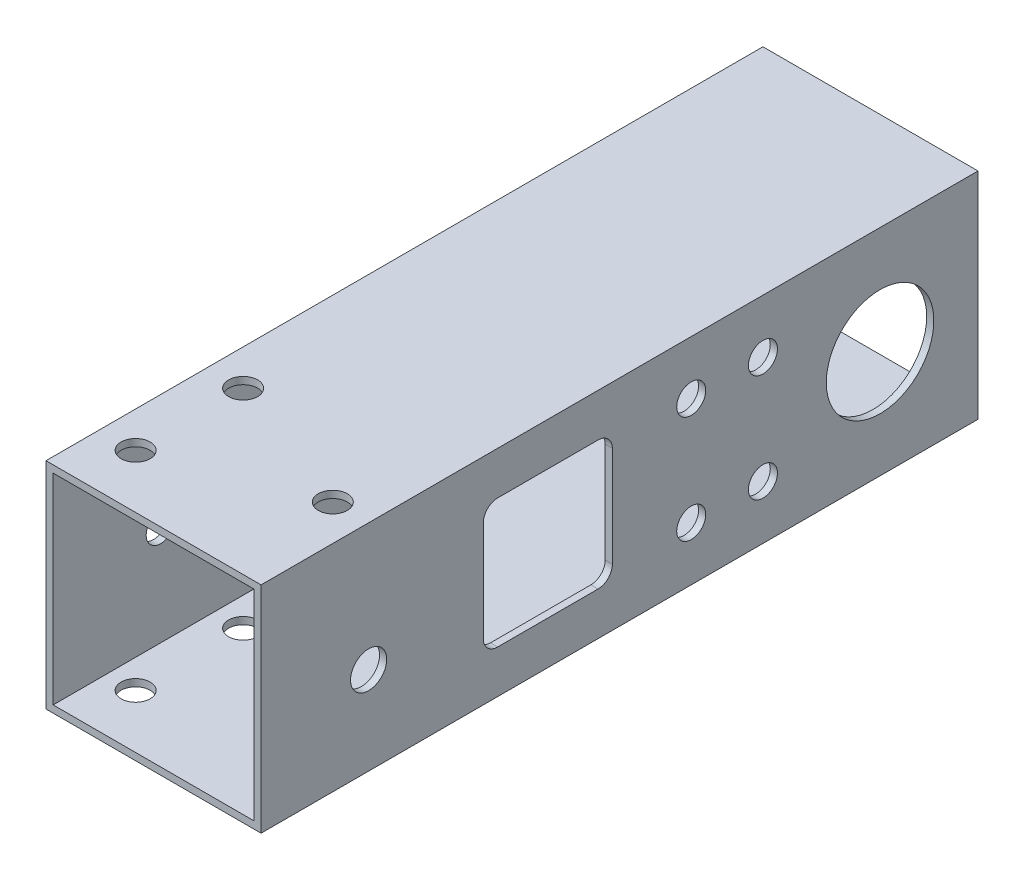
ISO-10303-21;
HEADER;
FILE_DESCRIPTION(('STEP AP214'),'2;1');
FILE_NAME('part.step','',(''),(''),'','','');
FILE_SCHEMA(('AUTOMOTIVE_DESIGN { 1 0 10303 214 1 1 1 1 }'));
ENDSEC;
DATA;
#1=APPLICATION_CONTEXT('core data for automotive mechanical design processes');
#2=APPLICATION_PROTOCOL_DEFINITION('international standard','automotive_design',2000,#1);
#3=PRODUCT_CONTEXT('',#1,'mechanical');
#4=PRODUCT('Part','Part','',(#3));
#5=PRODUCT_RELATED_PRODUCT_CATEGORY('part','',(#4));
#6=PRODUCT_DEFINITION_FORMATION('','',#4);
#7=PRODUCT_DEFINITION_CONTEXT('part definition',#1,'design');
#8=PRODUCT_DEFINITION('design','',#6,#7);
#9=PRODUCT_DEFINITION_SHAPE('','',#8);
#10=(LENGTH_UNIT() NAMED_UNIT(*) SI_UNIT(.MILLI.,.METRE.));
#11=(NAMED_UNIT(*) PLANE_ANGLE_UNIT() SI_UNIT($,.RADIAN.));
#12=(NAMED_UNIT(*) SI_UNIT($,.STERADIAN.) SOLID_ANGLE_UNIT());
#13=UNCERTAINTY_MEASURE_WITH_UNIT(LENGTH_MEASURE(1.E-05),#10,'distance_accuracy_value','');
#14=(GEOMETRIC_REPRESENTATION_CONTEXT(3) GLOBAL_UNCERTAINTY_ASSIGNED_CONTEXT((#13)) GLOBAL_UNIT_ASSIGNED_CONTEXT((#10,
#11,#12)) REPRESENTATION_CONTEXT('',''));
#15=CARTESIAN_POINT('',(0.,0.,0.));
#16=DIRECTION('',(0.,0.,1.));
#17=DIRECTION('',(1.,0.,0.));
#18=AXIS2_PLACEMENT_3D('',#15,#16,#17);
#19=CARTESIAN_POINT('',(15.,-15.,50.));
#20=DIRECTION('',(-1.,0.,0.));
#21=DIRECTION('',(0.,0.,1.));
#22=AXIS2_PLACEMENT_3D('',#19,#20,#21);
#23=PLANE('',#22);
#24=CARTESIAN_POINT('',(15.,-2.75,35.));
#25=DIRECTION('',(1.,0.,0.));
#26=DIRECTION('',(0.,0.,-1.));
#27=AXIS2_PLACEMENT_3D('',#24,#25,#26);
#28=CIRCLE('',#27,2.525);
#29=CARTESIAN_POINT('',(15.,-2.75,32.475));
#30=VERTEX_POINT('',#29);
#31=EDGE_CURVE('E766',#30,#30,#28,.T.);
#32=ORIENTED_EDGE('',*,*,#31,.F.);
#33=EDGE_LOOP('',(#32));
#34=FACE_BOUND('',#33,.T.);
#35=CARTESIAN_POINT('',(15.,7.50000000000101,-10.0000000000182));
#36=DIRECTION('',(-1.,0.,0.));
#37=DIRECTION('',(0.,0.,1.));
#38=AXIS2_PLACEMENT_3D('',#35,#36,#37);
#39=CIRCLE('',#38,2.025);
#40=CARTESIAN_POINT('',(15.,7.50000000000101,-7.9750000000182));
#41=VERTEX_POINT('',#40);
#42=EDGE_CURVE('E290',#41,#41,#39,.T.);
#43=ORIENTED_EDGE('',*,*,#42,.T.);
#44=EDGE_LOOP('',(#43));
#45=FACE_BOUND('',#44,.T.);
#46=CARTESIAN_POINT('',(15.,-7.49999999999899,-10.0000000000182));
#47=DIRECTION('',(-1.,0.,0.));
#48=DIRECTION('',(0.,0.,1.));
#49=AXIS2_PLACEMENT_3D('',#46,#47,#48);
#50=CIRCLE('',#49,2.025);
#51=CARTESIAN_POINT('',(15.,-7.49999999999899,-7.9750000000182));
#52=VERTEX_POINT('',#51);
#53=EDGE_CURVE('E782',#52,#52,#50,.T.);
#54=ORIENTED_EDGE('',*,*,#53,.T.);
#55=EDGE_LOOP('',(#54));
#56=FACE_BOUND('',#55,.T.);
#57=CARTESIAN_POINT('',(15.,0.,-36.3414768572115));
#58=DIRECTION('',(-1.,0.,0.));
#59=DIRECTION('',(0.,0.,1.));
#60=AXIS2_PLACEMENT_3D('',#57,#58,#59);
#61=CIRCLE('',#60,7.5);
#62=CARTESIAN_POINT('',(15.,0.,-28.8414768572115));
#63=VERTEX_POINT('',#62);
#64=EDGE_CURVE('E286',#63,#63,#61,.T.);
#65=ORIENTED_EDGE('',*,*,#64,.T.);
#66=EDGE_LOOP('',(#65));
#67=FACE_BOUND('',#66,.T.);
#68=CARTESIAN_POINT('',(15.,-7.49999999999899,-20.0000000000182));
#69=DIRECTION('',(-1.,0.,0.));
#70=DIRECTION('',(0.,0.,1.));
#71=AXIS2_PLACEMENT_3D('',#68,#69,#70);
#72=CIRCLE('',#71,2.025);
#73=CARTESIAN_POINT('',(15.,-7.49999999999899,-17.9750000000182));
#74=VERTEX_POINT('',#73);
#75=EDGE_CURVE('E276',#74,#74,#72,.T.);
#76=ORIENTED_EDGE('',*,*,#75,.T.);
#77=EDGE_LOOP('',(#76));
#78=FACE_BOUND('',#77,.T.);
#79=CARTESIAN_POINT('',(15.,7.50000000000101,-20.0000000000182));
#80=DIRECTION('',(-1.,0.,0.));
#81=DIRECTION('',(0.,0.,1.));
#82=AXIS2_PLACEMENT_3D('',#79,#80,#81);
#83=CIRCLE('',#82,2.025);
#84=CARTESIAN_POINT('',(15.,7.50000000000101,-17.9750000000182));
#85=VERTEX_POINT('',#84);
#86=EDGE_CURVE('E317',#85,#85,#83,.T.);
#87=ORIENTED_EDGE('',*,*,#86,.T.);
#88=EDGE_LOOP('',(#87));
#89=FACE_BOUND('',#88,.T.);
#90=DIRECTION('',(0.,0.,-1.));
#91=VECTOR('',#90,1.);
#92=CARTESIAN_POINT('',(15.,-8.99999999999998,0.99999999999998));
#93=LINE('',#92,#91);
#94=CARTESIAN_POINT('',(15.,-8.99999999999998,17.));
#95=VERTEX_POINT('',#94);
#96=CARTESIAN_POINT('',(15.,-8.99999999999998,2.99999999999998));
#97=VERTEX_POINT('',#96);
#98=EDGE_CURVE('E350',#95,#97,#93,.T.);
#99=ORIENTED_EDGE('',*,*,#98,.F.);
#100=CARTESIAN_POINT('',(15.,-6.99999999999998,17.));
#101=DIRECTION('',(-1.,0.,0.));
#102=DIRECTION('',(0.,0.,1.));
#103=AXIS2_PLACEMENT_3D('',#100,#101,#102);
#104=CIRCLE('',#103,2.);
#105=CARTESIAN_POINT('',(15.,-6.99999999999998,19.));
#106=VERTEX_POINT('',#105);
#107=EDGE_CURVE('E260',#95,#106,#104,.T.);
#108=ORIENTED_EDGE('',*,*,#107,.T.);
#109=DIRECTION('',(0.,-1.,0.));
#110=VECTOR('',#109,1.);
#111=CARTESIAN_POINT('',(15.,-8.99999999999998,19.));
#112=LINE('',#111,#110);
#113=CARTESIAN_POINT('',(15.,7.,19.));
#114=VERTEX_POINT('',#113);
#115=EDGE_CURVE('E354',#114,#106,#112,.T.);
#116=ORIENTED_EDGE('',*,*,#115,.F.);
#117=CARTESIAN_POINT('',(15.,7.,17.));
#118=DIRECTION('',(-1.,0.,0.));
#119=DIRECTION('',(0.,0.,1.));
#120=AXIS2_PLACEMENT_3D('',#117,#118,#119);
#121=CIRCLE('',#120,2.);
#122=CARTESIAN_POINT('',(15.,9.,17.));
#123=VERTEX_POINT('',#122);
#124=EDGE_CURVE('E257',#114,#123,#121,.T.);
#125=ORIENTED_EDGE('',*,*,#124,.T.);
#126=DIRECTION('',(0.,0.,1.));
#127=VECTOR('',#126,1.);
#128=CARTESIAN_POINT('',(15.,9.,0.99999999999998));
#129=LINE('',#128,#127);
#130=CARTESIAN_POINT('',(15.,9.,2.99999999999998));
#131=VERTEX_POINT('',#130);
#132=EDGE_CURVE('E357',#131,#123,#129,.T.);
#133=ORIENTED_EDGE('',*,*,#132,.F.);
#134=CARTESIAN_POINT('',(15.,7.,2.99999999999998));
#135=DIRECTION('',(-1.,0.,0.));
#136=DIRECTION('',(0.,0.,1.));
#137=AXIS2_PLACEMENT_3D('',#134,#135,#136);
#138=CIRCLE('',#137,2.);
#139=CARTESIAN_POINT('',(15.,7.,0.99999999999998));
#140=VERTEX_POINT('',#139);
#141=EDGE_CURVE('E11',#131,#140,#138,.T.);
#142=ORIENTED_EDGE('',*,*,#141,.T.);
#143=DIRECTION('',(0.,1.,0.));
#144=VECTOR('',#143,1.);
#145=CARTESIAN_POINT('',(15.,-8.99999999999998,0.99999999999998));
#146=LINE('',#145,#144);
#147=CARTESIAN_POINT('',(15.,-6.99999999999998,0.99999999999998));
#148=VERTEX_POINT('',#147);
#149=EDGE_CURVE('E347',#148,#140,#146,.T.);
#150=ORIENTED_EDGE('',*,*,#149,.F.);
#151=CARTESIAN_POINT('',(15.,-6.99999999999998,2.99999999999998));
#152=DIRECTION('',(-1.,0.,0.));
#153=DIRECTION('',(0.,0.,1.));
#154=AXIS2_PLACEMENT_3D('',#151,#152,#153);
#155=CIRCLE('',#154,2.);
#156=EDGE_CURVE('E254',#148,#97,#155,.T.);
#157=ORIENTED_EDGE('',*,*,#156,.T.);
#158=EDGE_LOOP('',(#99,#108,#116,#125,#133,#142,#150,#157));
#159=FACE_BOUND('',#158,.T.);
#160=DIRECTION('',(0.,1.,0.));
#161=VECTOR('',#160,1.);
#162=CARTESIAN_POINT('',(15.,-15.,-50.));
#163=LINE('',#162,#161);
#164=CARTESIAN_POINT('',(15.,-15.,-50.));
#165=VERTEX_POINT('',#164);
#166=CARTESIAN_POINT('',(15.,15.,-50.));
#167=VERTEX_POINT('',#166);
#168=EDGE_CURVE('E203',#165,#167,#163,.T.);
#169=ORIENTED_EDGE('',*,*,#168,.T.);
#170=DIRECTION('',(0.,0.,-1.));
#171=VECTOR('',#170,1.);
#172=CARTESIAN_POINT('',(15.,15.,50.));
#173=LINE('',#172,#171);
#174=CARTESIAN_POINT('',(15.,15.,50.));
#175=VERTEX_POINT('',#174);
#176=EDGE_CURVE('E230',#175,#167,#173,.T.);
#177=ORIENTED_EDGE('',*,*,#176,.F.);
#178=DIRECTION('',(0.,1.,0.));
#179=VECTOR('',#178,1.);
#180=CARTESIAN_POINT('',(15.,-15.,50.));
#181=LINE('',#180,#179);
#182=CARTESIAN_POINT('',(15.,-15.,50.));
#183=VERTEX_POINT('',#182);
#184=EDGE_CURVE('E204',#183,#175,#181,.T.);
#185=ORIENTED_EDGE('',*,*,#184,.F.);
#186=DIRECTION('',(0.,0.,-1.));
#187=VECTOR('',#186,1.);
#188=CARTESIAN_POINT('',(15.,-15.,50.));
#189=LINE('',#188,#187);
#190=EDGE_CURVE('E214',#183,#165,#189,.T.);
#191=ORIENTED_EDGE('',*,*,#190,.T.);
#192=EDGE_LOOP('',(#169,#177,#185,#191));
#193=FACE_BOUND('',#192,.T.);
#194=ADVANCED_FACE('F35',(#34,#45,#56,#67,#78,#89,#159,#193),#23,.F.);
#195=CARTESIAN_POINT('',(-15.,15.,50.));
#196=DIRECTION('',(0.,-1.,0.));
#197=DIRECTION('',(0.,0.,-1.));
#198=AXIS2_PLACEMENT_3D('',#195,#196,#197);
#199=PLANE('',#198);
#200=CARTESIAN_POINT('',(10.,15.,35.));
#201=DIRECTION('',(0.,-1.,0.));
#202=DIRECTION('',(0.,0.,-1.));
#203=AXIS2_PLACEMENT_3D('',#200,#201,#202);
#204=CIRCLE('',#203,2.025);
#205=CARTESIAN_POINT('',(10.,15.,32.975));
#206=VERTEX_POINT('',#205);
#207=EDGE_CURVE('E779',#206,#206,#204,.T.);
#208=ORIENTED_EDGE('',*,*,#207,.T.);
#209=EDGE_LOOP('',(#208));
#210=FACE_BOUND('',#209,.T.);
#211=CARTESIAN_POINT('',(-9.99999999999999,15.,27.5));
#212=DIRECTION('',(0.,1.,0.));
#213=DIRECTION('',(0.,0.,1.));
#214=AXIS2_PLACEMENT_3D('',#211,#212,#213);
#215=CIRCLE('',#214,2.025);
#216=CARTESIAN_POINT('',(-9.99999999999999,15.,29.525));
#217=VERTEX_POINT('',#216);
#218=EDGE_CURVE('E332',#217,#217,#215,.T.);
#219=ORIENTED_EDGE('',*,*,#218,.F.);
#220=EDGE_LOOP('',(#219));
#221=FACE_BOUND('',#220,.T.);
#222=CARTESIAN_POINT('',(-9.99999999999999,15.,42.5));
#223=DIRECTION('',(0.,1.,0.));
#224=DIRECTION('',(0.,0.,1.));
#225=AXIS2_PLACEMENT_3D('',#222,#223,#224);
#226=CIRCLE('',#225,2.025);
#227=CARTESIAN_POINT('',(-9.99999999999999,15.,44.525));
#228=VERTEX_POINT('',#227);
#229=EDGE_CURVE('E335',#228,#228,#226,.T.);
#230=ORIENTED_EDGE('',*,*,#229,.F.);
#231=EDGE_LOOP('',(#230));
#232=FACE_BOUND('',#231,.T.);
#233=DIRECTION('',(-1.,0.,0.));
#234=VECTOR('',#233,1.);
#235=CARTESIAN_POINT('',(-15.,15.,-50.));
#236=LINE('',#235,#234);
#237=CARTESIAN_POINT('',(-15.,15.,-50.));
#238=VERTEX_POINT('',#237);
#239=EDGE_CURVE('E217',#167,#238,#236,.T.);
#240=ORIENTED_EDGE('',*,*,#239,.T.);
#241=DIRECTION('',(0.,0.,-1.));
#242=VECTOR('',#241,1.);
#243=CARTESIAN_POINT('',(-15.,15.,50.));
#244=LINE('',#243,#242);
#245=CARTESIAN_POINT('',(-15.,15.,50.));
#246=VERTEX_POINT('',#245);
#247=EDGE_CURVE('E227',#246,#238,#244,.T.);
#248=ORIENTED_EDGE('',*,*,#247,.F.);
#249=DIRECTION('',(-1.,0.,0.));
#250=VECTOR('',#249,1.);
#251=CARTESIAN_POINT('',(-15.,15.,50.));
#252=LINE('',#251,#250);
#253=EDGE_CURVE('E207',#175,#246,#252,.T.);
#254=ORIENTED_EDGE('',*,*,#253,.F.);
#255=ORIENTED_EDGE('',*,*,#176,.T.);
#256=EDGE_LOOP('',(#240,#248,#254,#255));
#257=FACE_BOUND('',#256,.T.);
#258=ADVANCED_FACE('F402',(#210,#221,#232,#257),#199,.F.);
#259=CARTESIAN_POINT('',(-15.,-15.,50.));
#260=DIRECTION('',(1.,0.,0.));
#261=DIRECTION('',(0.,0.,-1.));
#262=AXIS2_PLACEMENT_3D('',#259,#260,#261);
#263=PLANE('',#262);
#264=CARTESIAN_POINT('',(-15.,7.50000000000101,-10.0000000000182));
#265=DIRECTION('',(1.,0.,0.));
#266=DIRECTION('',(0.,0.,-1.));
#267=AXIS2_PLACEMENT_3D('',#264,#265,#266);
#268=CIRCLE('',#267,2.025);
#269=CARTESIAN_POINT('',(-15.,7.50000000000101,-12.0250000000182));
#270=VERTEX_POINT('',#269);
#271=EDGE_CURVE('E298',#270,#270,#268,.T.);
#272=ORIENTED_EDGE('',*,*,#271,.T.);
#273=EDGE_LOOP('',(#272));
#274=FACE_BOUND('',#273,.T.);
#275=CARTESIAN_POINT('',(-15.,-7.49999999999899,-10.0000000000182));
#276=DIRECTION('',(1.,0.,0.));
#277=DIRECTION('',(0.,0.,-1.));
#278=AXIS2_PLACEMENT_3D('',#275,#276,#277);
#279=CIRCLE('',#278,2.025);
#280=CARTESIAN_POINT('',(-15.,-7.49999999999899,-12.0250000000182));
#281=VERTEX_POINT('',#280);
#282=EDGE_CURVE('E294',#281,#281,#279,.T.);
#283=ORIENTED_EDGE('',*,*,#282,.T.);
#284=EDGE_LOOP('',(#283));
#285=FACE_BOUND('',#284,.T.);
#286=CARTESIAN_POINT('',(-15.,0.,-36.3414768572115));
#287=DIRECTION('',(-1.,0.,0.));
#288=DIRECTION('',(0.,0.,1.));
#289=AXIS2_PLACEMENT_3D('',#286,#287,#288);
#290=CIRCLE('',#289,7.5);
#291=CARTESIAN_POINT('',(-15.,0.,-28.8414768572115));
#292=VERTEX_POINT('',#291);
#293=EDGE_CURVE('E310',#292,#292,#290,.T.);
#294=ORIENTED_EDGE('',*,*,#293,.F.);
#295=EDGE_LOOP('',(#294));
#296=FACE_BOUND('',#295,.T.);
#297=CARTESIAN_POINT('',(-15.,-7.49999999999899,-20.0000000000182));
#298=DIRECTION('',(1.,0.,0.));
#299=DIRECTION('',(0.,0.,-1.));
#300=AXIS2_PLACEMENT_3D('',#297,#298,#299);
#301=CIRCLE('',#300,2.025);
#302=CARTESIAN_POINT('',(-15.,-7.49999999999899,-22.0250000000182));
#303=VERTEX_POINT('',#302);
#304=EDGE_CURVE('E328',#303,#303,#301,.T.);
#305=ORIENTED_EDGE('',*,*,#304,.T.);
#306=EDGE_LOOP('',(#305));
#307=FACE_BOUND('',#306,.T.);
#308=CARTESIAN_POINT('',(-15.,7.50000000000101,-20.0000000000182));
#309=DIRECTION('',(1.,0.,0.));
#310=DIRECTION('',(0.,0.,-1.));
#311=AXIS2_PLACEMENT_3D('',#308,#309,#310);
#312=CIRCLE('',#311,2.025);
#313=CARTESIAN_POINT('',(-15.,7.50000000000101,-22.0250000000182));
#314=VERTEX_POINT('',#313);
#315=EDGE_CURVE('E281',#314,#314,#312,.T.);
#316=ORIENTED_EDGE('',*,*,#315,.T.);
#317=EDGE_LOOP('',(#316));
#318=FACE_BOUND('',#317,.T.);
#319=CARTESIAN_POINT('',(-15.,0.,9.99999999999997));
#320=DIRECTION('',(-1.,0.,0.));
#321=DIRECTION('',(0.,0.,1.));
#322=AXIS2_PLACEMENT_3D('',#319,#320,#321);
#323=CIRCLE('',#322,2.025);
#324=CARTESIAN_POINT('',(-15.,0.,12.025));
#325=VERTEX_POINT('',#324);
#326=EDGE_CURVE('E180',#325,#325,#323,.T.);
#327=ORIENTED_EDGE('',*,*,#326,.F.);
#328=EDGE_LOOP('',(#327));
#329=FACE_BOUND('',#328,.T.);
#330=CARTESIAN_POINT('',(-15.,0.,35.));
#331=DIRECTION('',(-1.,0.,0.));
#332=DIRECTION('',(0.,0.,1.));
#333=AXIS2_PLACEMENT_3D('',#330,#331,#332);
#334=CIRCLE('',#333,2.02499999999999);
#335=CARTESIAN_POINT('',(-15.,0.,37.025));
#336=VERTEX_POINT('',#335);
#337=EDGE_CURVE('E369',#336,#336,#334,.T.);
#338=ORIENTED_EDGE('',*,*,#337,.F.);
#339=EDGE_LOOP('',(#338));
#340=FACE_BOUND('',#339,.T.);
#341=DIRECTION('',(0.,-1.,0.));
#342=VECTOR('',#341,1.);
#343=CARTESIAN_POINT('',(-15.,-15.,-50.));
#344=LINE('',#343,#342);
#345=CARTESIAN_POINT('',(-15.,-15.,-50.));
#346=VERTEX_POINT('',#345);
#347=EDGE_CURVE('E219',#238,#346,#344,.T.);
#348=ORIENTED_EDGE('',*,*,#347,.T.);
#349=DIRECTION('',(0.,0.,-1.));
#350=VECTOR('',#349,1.);
#351=CARTESIAN_POINT('',(-15.,-15.,50.));
#352=LINE('',#351,#350);
#353=CARTESIAN_POINT('',(-15.,-15.,50.));
#354=VERTEX_POINT('',#353);
#355=EDGE_CURVE('E224',#354,#346,#352,.T.);
#356=ORIENTED_EDGE('',*,*,#355,.F.);
#357=DIRECTION('',(0.,-1.,0.));
#358=VECTOR('',#357,1.);
#359=CARTESIAN_POINT('',(-15.,-15.,50.));
#360=LINE('',#359,#358);
#361=EDGE_CURVE('E210',#246,#354,#360,.T.);
#362=ORIENTED_EDGE('',*,*,#361,.F.);
#363=ORIENTED_EDGE('',*,*,#247,.T.);
#364=EDGE_LOOP('',(#348,#356,#362,#363));
#365=FACE_BOUND('',#364,.T.);
#366=ADVANCED_FACE('F409',(#274,#285,#296,#307,#318,#329,#340,#365),#263,.F.);
#367=CARTESIAN_POINT('',(-15.,-15.,50.));
#368=DIRECTION('',(0.,1.,0.));
#369=DIRECTION('',(0.,0.,1.));
#370=AXIS2_PLACEMENT_3D('',#367,#368,#369);
#371=PLANE('',#370);
#372=CARTESIAN_POINT('',(10.,-15.,35.));
#373=DIRECTION('',(0.,1.,0.));
#374=DIRECTION('',(0.,0.,1.));
#375=AXIS2_PLACEMENT_3D('',#372,#373,#374);
#376=CIRCLE('',#375,2.025);
#377=CARTESIAN_POINT('',(10.,-15.,37.025));
#378=VERTEX_POINT('',#377);
#379=EDGE_CURVE('E770',#378,#378,#376,.T.);
#380=ORIENTED_EDGE('',*,*,#379,.T.);
#381=EDGE_LOOP('',(#380));
#382=FACE_BOUND('',#381,.T.);
#383=CARTESIAN_POINT('',(-9.99999999999999,-15.,27.5));
#384=DIRECTION('',(0.,1.,0.));
#385=DIRECTION('',(0.,0.,1.));
#386=AXIS2_PLACEMENT_3D('',#383,#384,#385);
#387=CIRCLE('',#386,2.025);
#388=CARTESIAN_POINT('',(-9.99999999999999,-15.,29.525));
#389=VERTEX_POINT('',#388);
#390=EDGE_CURVE('E267',#389,#389,#387,.T.);
#391=ORIENTED_EDGE('',*,*,#390,.T.);
#392=EDGE_LOOP('',(#391));
#393=FACE_BOUND('',#392,.T.);
#394=CARTESIAN_POINT('',(-9.99999999999999,-15.,42.5));
#395=DIRECTION('',(0.,1.,0.));
#396=DIRECTION('',(0.,0.,1.));
#397=AXIS2_PLACEMENT_3D('',#394,#395,#396);
#398=CIRCLE('',#397,2.025);
#399=CARTESIAN_POINT('',(-9.99999999999999,-15.,44.525));
#400=VERTEX_POINT('',#399);
#401=EDGE_CURVE('E331',#400,#400,#398,.T.);
#402=ORIENTED_EDGE('',*,*,#401,.T.);
#403=EDGE_LOOP('',(#402));
#404=FACE_BOUND('',#403,.T.);
#405=DIRECTION('',(1.,0.,0.));
#406=VECTOR('',#405,1.);
#407=CARTESIAN_POINT('',(-15.,-15.,-50.));
#408=LINE('',#407,#406);
#409=EDGE_CURVE('E208',#346,#165,#408,.T.);
#410=ORIENTED_EDGE('',*,*,#409,.T.);
#411=ORIENTED_EDGE('',*,*,#190,.F.);
#412=DIRECTION('',(1.,0.,0.));
#413=VECTOR('',#412,1.);
#414=CARTESIAN_POINT('',(-15.,-15.,50.));
#415=LINE('',#414,#413);
#416=EDGE_CURVE('E212',#354,#183,#415,.T.);
#417=ORIENTED_EDGE('',*,*,#416,.F.);
#418=ORIENTED_EDGE('',*,*,#355,.T.);
#419=EDGE_LOOP('',(#410,#411,#417,#418));
#420=FACE_BOUND('',#419,.T.);
#421=ADVANCED_FACE('F629',(#382,#393,#404,#420),#371,.F.);
#422=CARTESIAN_POINT('',(0.,0.,50.));
#423=DIRECTION('',(0.,0.,-1.));
#424=DIRECTION('',(-1.,0.,0.));
#425=AXIS2_PLACEMENT_3D('',#422,#423,#424);
#426=PLANE('',#425);
#427=DIRECTION('',(0.,-1.,0.));
#428=VECTOR('',#427,1.);
#429=CARTESIAN_POINT('',(14.,0.,50.));
#430=LINE('',#429,#428);
#431=CARTESIAN_POINT('',(14.,14.,50.));
#432=VERTEX_POINT('',#431);
#433=CARTESIAN_POINT('',(14.,-14.,50.));
#434=VERTEX_POINT('',#433);
#435=EDGE_CURVE('E190',#432,#434,#430,.T.);
#436=ORIENTED_EDGE('',*,*,#435,.T.);
#437=DIRECTION('',(-1.,0.,0.));
#438=VECTOR('',#437,1.);
#439=CARTESIAN_POINT('',(0.,-14.,50.));
#440=LINE('',#439,#438);
#441=CARTESIAN_POINT('',(-14.,-14.,50.));
#442=VERTEX_POINT('',#441);
#443=EDGE_CURVE('E159',#434,#442,#440,.T.);
#444=ORIENTED_EDGE('',*,*,#443,.T.);
#445=DIRECTION('',(0.,1.,0.));
#446=VECTOR('',#445,1.);
#447=CARTESIAN_POINT('',(-14.,0.,50.));
#448=LINE('',#447,#446);
#449=CARTESIAN_POINT('',(-14.,14.,50.));
#450=VERTEX_POINT('',#449);
#451=EDGE_CURVE('E199',#442,#450,#448,.T.);
#452=ORIENTED_EDGE('',*,*,#451,.T.);
#453=DIRECTION('',(1.,0.,0.));
#454=VECTOR('',#453,1.);
#455=CARTESIAN_POINT('',(0.,14.,50.));
#456=LINE('',#455,#454);
#457=EDGE_CURVE('E196',#450,#432,#456,.T.);
#458=ORIENTED_EDGE('',*,*,#457,.T.);
#459=EDGE_LOOP('',(#436,#444,#452,#458));
#460=FACE_BOUND('',#459,.T.);
#461=ORIENTED_EDGE('',*,*,#184,.T.);
#462=ORIENTED_EDGE('',*,*,#253,.T.);
#463=ORIENTED_EDGE('',*,*,#361,.T.);
#464=ORIENTED_EDGE('',*,*,#416,.T.);
#465=EDGE_LOOP('',(#461,#462,#463,#464));
#466=FACE_BOUND('',#465,.T.);
#467=ADVANCED_FACE('F386',(#460,#466),#426,.F.);
#468=CARTESIAN_POINT('',(0.,0.,-50.));
#469=DIRECTION('',(0.,0.,-1.));
#470=DIRECTION('',(-1.,0.,0.));
#471=AXIS2_PLACEMENT_3D('',#468,#469,#470);
#472=PLANE('',#471);
#473=DIRECTION('',(1.,0.,0.));
#474=VECTOR('',#473,1.);
#475=CARTESIAN_POINT('',(-14.,-14.,-50.));
#476=LINE('',#475,#474);
#477=CARTESIAN_POINT('',(-14.,-14.,-50.));
#478=VERTEX_POINT('',#477);
#479=CARTESIAN_POINT('',(14.,-14.,-50.));
#480=VERTEX_POINT('',#479);
#481=EDGE_CURVE('E156',#478,#480,#476,.T.);
#482=ORIENTED_EDGE('',*,*,#481,.T.);
#483=DIRECTION('',(0.,1.,0.));
#484=VECTOR('',#483,1.);
#485=CARTESIAN_POINT('',(14.,-14.,-50.));
#486=LINE('',#485,#484);
#487=CARTESIAN_POINT('',(14.,14.,-50.));
#488=VERTEX_POINT('',#487);
#489=EDGE_CURVE('E167',#480,#488,#486,.T.);
#490=ORIENTED_EDGE('',*,*,#489,.T.);
#491=DIRECTION('',(-1.,0.,0.));
#492=VECTOR('',#491,1.);
#493=CARTESIAN_POINT('',(14.,14.,-50.));
#494=LINE('',#493,#492);
#495=CARTESIAN_POINT('',(-14.,14.,-50.));
#496=VERTEX_POINT('',#495);
#497=EDGE_CURVE('E172',#488,#496,#494,.T.);
#498=ORIENTED_EDGE('',*,*,#497,.T.);
#499=DIRECTION('',(0.,-1.,0.));
#500=VECTOR('',#499,1.);
#501=CARTESIAN_POINT('',(-14.,14.,-50.));
#502=LINE('',#501,#500);
#503=EDGE_CURVE('E163',#496,#478,#502,.T.);
#504=ORIENTED_EDGE('',*,*,#503,.T.);
#505=EDGE_LOOP('',(#482,#490,#498,#504));
#506=FACE_BOUND('',#505,.T.);
#507=ORIENTED_EDGE('',*,*,#168,.F.);
#508=ORIENTED_EDGE('',*,*,#409,.F.);
#509=ORIENTED_EDGE('',*,*,#347,.F.);
#510=ORIENTED_EDGE('',*,*,#239,.F.);
#511=EDGE_LOOP('',(#507,#508,#509,#510));
#512=FACE_BOUND('',#511,.T.);
#513=ADVANCED_FACE('F174',(#506,#512),#472,.T.);
#514=CARTESIAN_POINT('',(-14.,-14.,-50.));
#515=DIRECTION('',(0.,-1.,0.));
#516=DIRECTION('',(0.,0.,-1.));
#517=AXIS2_PLACEMENT_3D('',#514,#515,#516);
#518=PLANE('',#517);
#519=CARTESIAN_POINT('',(10.,-14.,35.));
#520=DIRECTION('',(0.,-1.,0.));
#521=DIRECTION('',(0.,0.,-1.));
#522=AXIS2_PLACEMENT_3D('',#519,#520,#521);
#523=CIRCLE('',#522,2.025);
#524=CARTESIAN_POINT('',(10.,-14.,32.975));
#525=VERTEX_POINT('',#524);
#526=EDGE_CURVE('E776',#525,#525,#523,.T.);
#527=ORIENTED_EDGE('',*,*,#526,.T.);
#528=EDGE_LOOP('',(#527));
#529=FACE_BOUND('',#528,.T.);
#530=CARTESIAN_POINT('',(-9.99999999999999,-14.,27.5));
#531=DIRECTION('',(0.,-1.,0.));
#532=DIRECTION('',(0.,0.,-1.));
#533=AXIS2_PLACEMENT_3D('',#530,#531,#532);
#534=CIRCLE('',#533,2.025);
#535=CARTESIAN_POINT('',(-9.99999999999999,-14.,25.475));
#536=VERTEX_POINT('',#535);
#537=EDGE_CURVE('E271',#536,#536,#534,.T.);
#538=ORIENTED_EDGE('',*,*,#537,.T.);
#539=EDGE_LOOP('',(#538));
#540=FACE_BOUND('',#539,.T.);
#541=CARTESIAN_POINT('',(-9.99999999999999,-14.,42.5));
#542=DIRECTION('',(0.,-1.,0.));
#543=DIRECTION('',(0.,0.,-1.));
#544=AXIS2_PLACEMENT_3D('',#541,#542,#543);
#545=CIRCLE('',#544,2.025);
#546=CARTESIAN_POINT('',(-9.99999999999999,-14.,40.475));
#547=VERTEX_POINT('',#546);
#548=EDGE_CURVE('E266',#547,#547,#545,.T.);
#549=ORIENTED_EDGE('',*,*,#548,.T.);
#550=EDGE_LOOP('',(#549));
#551=FACE_BOUND('',#550,.T.);
#552=DIRECTION('',(0.,0.,1.));
#553=VECTOR('',#552,1.);
#554=CARTESIAN_POINT('',(14.,-14.,-50.));
#555=LINE('',#554,#553);
#556=EDGE_CURVE('E151',#480,#434,#555,.T.);
#557=ORIENTED_EDGE('',*,*,#556,.F.);
#558=ORIENTED_EDGE('',*,*,#481,.F.);
#559=DIRECTION('',(0.,0.,1.));
#560=VECTOR('',#559,1.);
#561=CARTESIAN_POINT('',(-14.,-14.,-50.));
#562=LINE('',#561,#560);
#563=EDGE_CURVE('E188',#478,#442,#562,.T.);
#564=ORIENTED_EDGE('',*,*,#563,.T.);
#565=ORIENTED_EDGE('',*,*,#443,.F.);
#566=EDGE_LOOP('',(#557,#558,#564,#565));
#567=FACE_BOUND('',#566,.T.);
#568=ADVANCED_FACE('F153',(#529,#540,#551,#567),#518,.F.);
#569=CARTESIAN_POINT('',(-14.,14.,-50.));
#570=DIRECTION('',(-1.,0.,0.));
#571=DIRECTION('',(0.,0.,1.));
#572=AXIS2_PLACEMENT_3D('',#569,#570,#571);
#573=PLANE('',#572);
#574=CARTESIAN_POINT('',(-14.,7.50000000000101,-10.0000000000182));
#575=DIRECTION('',(-1.,0.,0.));
#576=DIRECTION('',(0.,0.,1.));
#577=AXIS2_PLACEMENT_3D('',#574,#575,#576);
#578=CIRCLE('',#577,2.025);
#579=CARTESIAN_POINT('',(-14.,7.50000000000101,-7.9750000000182));
#580=VERTEX_POINT('',#579);
#581=EDGE_CURVE('E293',#580,#580,#578,.T.);
#582=ORIENTED_EDGE('',*,*,#581,.T.);
#583=EDGE_LOOP('',(#582));
#584=FACE_BOUND('',#583,.T.);
#585=CARTESIAN_POINT('',(-14.,-7.49999999999899,-10.0000000000182));
#586=DIRECTION('',(-1.,0.,0.));
#587=DIRECTION('',(0.,0.,1.));
#588=AXIS2_PLACEMENT_3D('',#585,#586,#587);
#589=CIRCLE('',#588,2.025);
#590=CARTESIAN_POINT('',(-14.,-7.49999999999899,-7.9750000000182));
#591=VERTEX_POINT('',#590);
#592=EDGE_CURVE('E289',#591,#591,#589,.T.);
#593=ORIENTED_EDGE('',*,*,#592,.T.);
#594=EDGE_LOOP('',(#593));
#595=FACE_BOUND('',#594,.T.);
#596=CARTESIAN_POINT('',(-14.,0.,-36.3414768572115));
#597=DIRECTION('',(-1.,0.,0.));
#598=DIRECTION('',(0.,0.,1.));
#599=AXIS2_PLACEMENT_3D('',#596,#597,#598);
#600=CIRCLE('',#599,7.5);
#601=CARTESIAN_POINT('',(-14.,0.,-28.8414768572115));
#602=VERTEX_POINT('',#601);
#603=EDGE_CURVE('E285',#602,#602,#600,.T.);
#604=ORIENTED_EDGE('',*,*,#603,.T.);
#605=EDGE_LOOP('',(#604));
#606=FACE_BOUND('',#605,.T.);
#607=CARTESIAN_POINT('',(-14.,-7.49999999999899,-20.0000000000182));
#608=DIRECTION('',(-1.,0.,0.));
#609=DIRECTION('',(0.,0.,1.));
#610=AXIS2_PLACEMENT_3D('',#607,#608,#609);
#611=CIRCLE('',#610,2.025);
#612=CARTESIAN_POINT('',(-14.,-7.49999999999899,-17.9750000000182));
#613=VERTEX_POINT('',#612);
#614=EDGE_CURVE('E280',#613,#613,#611,.T.);
#615=ORIENTED_EDGE('',*,*,#614,.T.);
#616=EDGE_LOOP('',(#615));
#617=FACE_BOUND('',#616,.T.);
#618=CARTESIAN_POINT('',(-14.,7.50000000000101,-20.0000000000182));
#619=DIRECTION('',(-1.,0.,0.));
#620=DIRECTION('',(0.,0.,1.));
#621=AXIS2_PLACEMENT_3D('',#618,#619,#620);
#622=CIRCLE('',#621,2.025);
#623=CARTESIAN_POINT('',(-14.,7.50000000000101,-17.9750000000182));
#624=VERTEX_POINT('',#623);
#625=EDGE_CURVE('E275',#624,#624,#622,.T.);
#626=ORIENTED_EDGE('',*,*,#625,.T.);
#627=EDGE_LOOP('',(#626));
#628=FACE_BOUND('',#627,.T.);
#629=CARTESIAN_POINT('',(-14.,0.,9.99999999999997));
#630=DIRECTION('',(-1.,0.,0.));
#631=DIRECTION('',(0.,0.,1.));
#632=AXIS2_PLACEMENT_3D('',#629,#630,#631);
#633=CIRCLE('',#632,2.025);
#634=CARTESIAN_POINT('',(-14.,0.,12.025));
#635=VERTEX_POINT('',#634);
#636=EDGE_CURVE('E177',#635,#635,#633,.F.);
#637=ORIENTED_EDGE('',*,*,#636,.F.);
#638=EDGE_LOOP('',(#637));
#639=FACE_BOUND('',#638,.T.);
#640=CARTESIAN_POINT('',(-14.,0.,35.));
#641=DIRECTION('',(-1.,0.,0.));
#642=DIRECTION('',(0.,0.,1.));
#643=AXIS2_PLACEMENT_3D('',#640,#641,#642);
#644=CIRCLE('',#643,2.02499999999999);
#645=CARTESIAN_POINT('',(-14.,0.,37.025));
#646=VERTEX_POINT('',#645);
#647=EDGE_CURVE('E183',#646,#646,#644,.F.);
#648=ORIENTED_EDGE('',*,*,#647,.F.);
#649=EDGE_LOOP('',(#648));
#650=FACE_BOUND('',#649,.T.);
#651=ORIENTED_EDGE('',*,*,#563,.F.);
#652=ORIENTED_EDGE('',*,*,#503,.F.);
#653=DIRECTION('',(0.,0.,1.));
#654=VECTOR('',#653,1.);
#655=CARTESIAN_POINT('',(-14.,14.,-50.));
#656=LINE('',#655,#654);
#657=EDGE_CURVE('E191',#496,#450,#656,.T.);
#658=ORIENTED_EDGE('',*,*,#657,.T.);
#659=ORIENTED_EDGE('',*,*,#451,.F.);
#660=EDGE_LOOP('',(#651,#652,#658,#659));
#661=FACE_BOUND('',#660,.T.);
#662=ADVANCED_FACE('F379',(#584,#595,#606,#617,#628,#639,#650,#661),#573,.F.);
#663=CARTESIAN_POINT('',(14.,14.,-50.));
#664=DIRECTION('',(0.,1.,0.));
#665=DIRECTION('',(0.,0.,1.));
#666=AXIS2_PLACEMENT_3D('',#663,#664,#665);
#667=PLANE('',#666);
#668=CARTESIAN_POINT('',(10.,14.,35.));
#669=DIRECTION('',(0.,1.,0.));
#670=DIRECTION('',(0.,0.,1.));
#671=AXIS2_PLACEMENT_3D('',#668,#669,#670);
#672=CIRCLE('',#671,2.025);
#673=CARTESIAN_POINT('',(10.,14.,37.025));
#674=VERTEX_POINT('',#673);
#675=EDGE_CURVE('E39',#674,#674,#672,.T.);
#676=ORIENTED_EDGE('',*,*,#675,.T.);
#677=EDGE_LOOP('',(#676));
#678=FACE_BOUND('',#677,.T.);
#679=CARTESIAN_POINT('',(-9.99999999999999,14.,27.5));
#680=DIRECTION('',(0.,1.,0.));
#681=DIRECTION('',(0.,0.,1.));
#682=AXIS2_PLACEMENT_3D('',#679,#680,#681);
#683=CIRCLE('',#682,2.025);
#684=CARTESIAN_POINT('',(-9.99999999999999,14.,29.525));
#685=VERTEX_POINT('',#684);
#686=EDGE_CURVE('E268',#685,#685,#683,.T.);
#687=ORIENTED_EDGE('',*,*,#686,.T.);
#688=EDGE_LOOP('',(#687));
#689=FACE_BOUND('',#688,.T.);
#690=CARTESIAN_POINT('',(-9.99999999999999,14.,42.5));
#691=DIRECTION('',(0.,1.,0.));
#692=DIRECTION('',(0.,0.,1.));
#693=AXIS2_PLACEMENT_3D('',#690,#691,#692);
#694=CIRCLE('',#693,2.025);
#695=CARTESIAN_POINT('',(-9.99999999999999,14.,44.525));
#696=VERTEX_POINT('',#695);
#697=EDGE_CURVE('E263',#696,#696,#694,.T.);
#698=ORIENTED_EDGE('',*,*,#697,.T.);
#699=EDGE_LOOP('',(#698));
#700=FACE_BOUND('',#699,.T.);
#701=ORIENTED_EDGE('',*,*,#657,.F.);
#702=ORIENTED_EDGE('',*,*,#497,.F.);
#703=DIRECTION('',(0.,0.,1.));
#704=VECTOR('',#703,1.);
#705=CARTESIAN_POINT('',(14.,14.,-50.));
#706=LINE('',#705,#704);
#707=EDGE_CURVE('E162',#488,#432,#706,.T.);
#708=ORIENTED_EDGE('',*,*,#707,.T.);
#709=ORIENTED_EDGE('',*,*,#457,.F.);
#710=EDGE_LOOP('',(#701,#702,#708,#709));
#711=FACE_BOUND('',#710,.T.);
#712=ADVANCED_FACE('F382',(#678,#689,#700,#711),#667,.F.);
#713=CARTESIAN_POINT('',(14.,-14.,-50.));
#714=DIRECTION('',(1.,0.,0.));
#715=DIRECTION('',(0.,0.,-1.));
#716=AXIS2_PLACEMENT_3D('',#713,#714,#715);
#717=PLANE('',#716);
#718=CARTESIAN_POINT('',(14.,-2.75,35.));
#719=DIRECTION('',(1.,0.,0.));
#720=DIRECTION('',(0.,0.,-1.));
#721=AXIS2_PLACEMENT_3D('',#718,#719,#720);
#722=CIRCLE('',#721,2.525);
#723=CARTESIAN_POINT('',(14.,-2.75,32.475));
#724=VERTEX_POINT('',#723);
#725=EDGE_CURVE('E769',#724,#724,#722,.F.);
#726=ORIENTED_EDGE('',*,*,#725,.F.);
#727=EDGE_LOOP('',(#726));
#728=FACE_BOUND('',#727,.T.);
#729=CARTESIAN_POINT('',(14.,7.50000000000101,-10.0000000000182));
#730=DIRECTION('',(1.,0.,0.));
#731=DIRECTION('',(0.,0.,-1.));
#732=AXIS2_PLACEMENT_3D('',#729,#730,#731);
#733=CIRCLE('',#732,2.025);
#734=CARTESIAN_POINT('',(14.,7.50000000000101,-12.0250000000182));
#735=VERTEX_POINT('',#734);
#736=EDGE_CURVE('E291',#735,#735,#733,.T.);
#737=ORIENTED_EDGE('',*,*,#736,.T.);
#738=EDGE_LOOP('',(#737));
#739=FACE_BOUND('',#738,.T.);
#740=CARTESIAN_POINT('',(14.,-7.49999999999899,-10.0000000000182));
#741=DIRECTION('',(1.,0.,0.));
#742=DIRECTION('',(0.,0.,-1.));
#743=AXIS2_PLACEMENT_3D('',#740,#741,#742);
#744=CIRCLE('',#743,2.025);
#745=CARTESIAN_POINT('',(14.,-7.49999999999899,-12.0250000000182));
#746=VERTEX_POINT('',#745);
#747=EDGE_CURVE('E287',#746,#746,#744,.T.);
#748=ORIENTED_EDGE('',*,*,#747,.T.);
#749=EDGE_LOOP('',(#748));
#750=FACE_BOUND('',#749,.T.);
#751=CARTESIAN_POINT('',(14.,0.,-36.3414768572115));
#752=DIRECTION('',(1.,0.,0.));
#753=DIRECTION('',(0.,0.,-1.));
#754=AXIS2_PLACEMENT_3D('',#751,#752,#753);
#755=CIRCLE('',#754,7.5);
#756=CARTESIAN_POINT('',(14.,0.,-43.8414768572115));
#757=VERTEX_POINT('',#756);
#758=EDGE_CURVE('E282',#757,#757,#755,.T.);
#759=ORIENTED_EDGE('',*,*,#758,.T.);
#760=EDGE_LOOP('',(#759));
#761=FACE_BOUND('',#760,.T.);
#762=CARTESIAN_POINT('',(14.,-7.49999999999899,-20.0000000000182));
#763=DIRECTION('',(1.,0.,0.));
#764=DIRECTION('',(0.,0.,-1.));
#765=AXIS2_PLACEMENT_3D('',#762,#763,#764);
#766=CIRCLE('',#765,2.025);
#767=CARTESIAN_POINT('',(14.,-7.49999999999899,-22.0250000000182));
#768=VERTEX_POINT('',#767);
#769=EDGE_CURVE('E277',#768,#768,#766,.T.);
#770=ORIENTED_EDGE('',*,*,#769,.T.);
#771=EDGE_LOOP('',(#770));
#772=FACE_BOUND('',#771,.T.);
#773=CARTESIAN_POINT('',(14.,7.50000000000101,-20.0000000000182));
#774=DIRECTION('',(1.,0.,0.));
#775=DIRECTION('',(0.,0.,-1.));
#776=AXIS2_PLACEMENT_3D('',#773,#774,#775);
#777=CIRCLE('',#776,2.025);
#778=CARTESIAN_POINT('',(14.,7.50000000000101,-22.0250000000182));
#779=VERTEX_POINT('',#778);
#780=EDGE_CURVE('E272',#779,#779,#777,.T.);
#781=ORIENTED_EDGE('',*,*,#780,.T.);
#782=EDGE_LOOP('',(#781));
#783=FACE_BOUND('',#782,.T.);
#784=DIRECTION('',(0.,0.,-1.));
#785=VECTOR('',#784,1.);
#786=CARTESIAN_POINT('',(14.,9.,0.99999999999998));
#787=LINE('',#786,#785);
#788=CARTESIAN_POINT('',(14.,9.,17.));
#789=VERTEX_POINT('',#788);
#790=CARTESIAN_POINT('',(14.,9.,2.99999999999998));
#791=VERTEX_POINT('',#790);
#792=EDGE_CURVE('E359',#789,#791,#787,.T.);
#793=ORIENTED_EDGE('',*,*,#792,.F.);
#794=CARTESIAN_POINT('',(14.,7.,17.));
#795=DIRECTION('',(1.,0.,0.));
#796=DIRECTION('',(0.,0.,-1.));
#797=AXIS2_PLACEMENT_3D('',#794,#795,#796);
#798=CIRCLE('',#797,2.);
#799=CARTESIAN_POINT('',(14.,7.,19.));
#800=VERTEX_POINT('',#799);
#801=EDGE_CURVE('E52',#789,#800,#798,.T.);
#802=ORIENTED_EDGE('',*,*,#801,.T.);
#803=DIRECTION('',(0.,1.,0.));
#804=VECTOR('',#803,1.);
#805=CARTESIAN_POINT('',(14.,-8.99999999999998,19.));
#806=LINE('',#805,#804);
#807=CARTESIAN_POINT('',(14.,-6.99999999999998,19.));
#808=VERTEX_POINT('',#807);
#809=EDGE_CURVE('E346',#808,#800,#806,.T.);
#810=ORIENTED_EDGE('',*,*,#809,.F.);
#811=CARTESIAN_POINT('',(14.,-6.99999999999998,17.));
#812=DIRECTION('',(1.,0.,0.));
#813=DIRECTION('',(0.,0.,-1.));
#814=AXIS2_PLACEMENT_3D('',#811,#812,#813);
#815=CIRCLE('',#814,2.);
#816=CARTESIAN_POINT('',(14.,-8.99999999999998,17.));
#817=VERTEX_POINT('',#816);
#818=EDGE_CURVE('E60',#808,#817,#815,.T.);
#819=ORIENTED_EDGE('',*,*,#818,.T.);
#820=DIRECTION('',(0.,0.,1.));
#821=VECTOR('',#820,1.);
#822=CARTESIAN_POINT('',(14.,-8.99999999999998,0.99999999999998));
#823=LINE('',#822,#821);
#824=CARTESIAN_POINT('',(14.,-8.99999999999998,2.99999999999998));
#825=VERTEX_POINT('',#824);
#826=EDGE_CURVE('E351',#825,#817,#823,.T.);
#827=ORIENTED_EDGE('',*,*,#826,.F.);
#828=CARTESIAN_POINT('',(14.,-6.99999999999998,2.99999999999998));
#829=DIRECTION('',(1.,0.,0.));
#830=DIRECTION('',(0.,0.,-1.));
#831=AXIS2_PLACEMENT_3D('',#828,#829,#830);
#832=CIRCLE('',#831,2.);
#833=CARTESIAN_POINT('',(14.,-6.99999999999998,0.99999999999998));
#834=VERTEX_POINT('',#833);
#835=EDGE_CURVE('E252',#825,#834,#832,.T.);
#836=ORIENTED_EDGE('',*,*,#835,.T.);
#837=DIRECTION('',(0.,-1.,0.));
#838=VECTOR('',#837,1.);
#839=CARTESIAN_POINT('',(14.,-8.99999999999998,0.99999999999998));
#840=LINE('',#839,#838);
#841=CARTESIAN_POINT('',(14.,7.,0.99999999999998));
#842=VERTEX_POINT('',#841);
#843=EDGE_CURVE('E362',#842,#834,#840,.T.);
#844=ORIENTED_EDGE('',*,*,#843,.F.);
#845=CARTESIAN_POINT('',(14.,7.,2.99999999999998));
#846=DIRECTION('',(1.,0.,0.));
#847=DIRECTION('',(0.,0.,-1.));
#848=AXIS2_PLACEMENT_3D('',#845,#846,#847);
#849=CIRCLE('',#848,2.);
#850=EDGE_CURVE('E44',#842,#791,#849,.T.);
#851=ORIENTED_EDGE('',*,*,#850,.T.);
#852=EDGE_LOOP('',(#793,#802,#810,#819,#827,#836,#844,#851));
#853=FACE_BOUND('',#852,.T.);
#854=ORIENTED_EDGE('',*,*,#707,.F.);
#855=ORIENTED_EDGE('',*,*,#489,.F.);
#856=ORIENTED_EDGE('',*,*,#556,.T.);
#857=ORIENTED_EDGE('',*,*,#435,.F.);
#858=EDGE_LOOP('',(#854,#855,#856,#857));
#859=FACE_BOUND('',#858,.T.);
#860=ADVANCED_FACE('F168',(#728,#739,#750,#761,#772,#783,#853,#859),#717,.F.);
#861=CARTESIAN_POINT('',(-8.27243507238897,0.,35.));
#862=DIRECTION('',(-1.,0.,0.));
#863=DIRECTION('',(0.,0.,1.));
#864=AXIS2_PLACEMENT_3D('',#861,#862,#863);
#865=CYLINDRICAL_SURFACE('',#864,2.02499999999999);
#866=ORIENTED_EDGE('',*,*,#647,.T.);
#867=EDGE_LOOP('',(#866));
#868=FACE_BOUND('',#867,.T.);
#869=ORIENTED_EDGE('',*,*,#337,.T.);
#870=EDGE_LOOP('',(#869));
#871=FACE_BOUND('',#870,.T.);
#872=ADVANCED_FACE('F377',(#868,#871),#865,.F.);
#873=CARTESIAN_POINT('',(-8.27243507238897,0.,9.99999999999997));
#874=DIRECTION('',(-1.,0.,0.));
#875=DIRECTION('',(0.,0.,1.));
#876=AXIS2_PLACEMENT_3D('',#873,#874,#875);
#877=CYLINDRICAL_SURFACE('',#876,2.025);
#878=ORIENTED_EDGE('',*,*,#636,.T.);
#879=EDGE_LOOP('',(#878));
#880=FACE_BOUND('',#879,.T.);
#881=ORIENTED_EDGE('',*,*,#326,.T.);
#882=EDGE_LOOP('',(#881));
#883=FACE_BOUND('',#882,.T.);
#884=ADVANCED_FACE('F463',(#880,#883),#877,.F.);
#885=CARTESIAN_POINT('',(40.4558441227157,-8.99999999999998,19.));
#886=DIRECTION('',(0.,0.,1.));
#887=DIRECTION('',(1.,0.,0.));
#888=AXIS2_PLACEMENT_3D('',#885,#886,#887);
#889=PLANE('',#888);
#890=ORIENTED_EDGE('',*,*,#809,.T.);
#891=DIRECTION('',(-1.,0.,0.));
#892=VECTOR('',#891,1.);
#893=CARTESIAN_POINT('',(15.,7.,19.));
#894=LINE('',#893,#892);
#895=EDGE_CURVE('E250',#800,#114,#894,.F.);
#896=ORIENTED_EDGE('',*,*,#895,.T.);
#897=ORIENTED_EDGE('',*,*,#115,.T.);
#898=DIRECTION('',(-1.,0.,0.));
#899=VECTOR('',#898,1.);
#900=CARTESIAN_POINT('',(14.,-6.99999999999998,19.));
#901=LINE('',#900,#899);
#902=EDGE_CURVE('E248',#106,#808,#901,.T.);
#903=ORIENTED_EDGE('',*,*,#902,.T.);
#904=EDGE_LOOP('',(#890,#896,#897,#903));
#905=FACE_BOUND('',#904,.T.);
#906=ADVANCED_FACE('F438',(#905),#889,.F.);
#907=CARTESIAN_POINT('',(40.4558441227157,-8.99999999999998,0.99999999999998));
#908=DIRECTION('',(0.,-1.,0.));
#909=DIRECTION('',(0.,0.,-1.));
#910=AXIS2_PLACEMENT_3D('',#907,#908,#909);
#911=PLANE('',#910);
#912=ORIENTED_EDGE('',*,*,#98,.T.);
#913=DIRECTION('',(-1.,0.,0.));
#914=VECTOR('',#913,1.);
#915=CARTESIAN_POINT('',(14.,-8.99999999999998,2.99999999999998));
#916=LINE('',#915,#914);
#917=EDGE_CURVE('E235',#97,#825,#916,.T.);
#918=ORIENTED_EDGE('',*,*,#917,.T.);
#919=ORIENTED_EDGE('',*,*,#826,.T.);
#920=DIRECTION('',(-1.,0.,0.));
#921=VECTOR('',#920,1.);
#922=CARTESIAN_POINT('',(15.,-8.99999999999998,17.));
#923=LINE('',#922,#921);
#924=EDGE_CURVE('E233',#817,#95,#923,.F.);
#925=ORIENTED_EDGE('',*,*,#924,.T.);
#926=EDGE_LOOP('',(#912,#918,#919,#925));
#927=FACE_BOUND('',#926,.T.);
#928=ADVANCED_FACE('F454',(#927),#911,.F.);
#929=CARTESIAN_POINT('',(40.4558441227157,-8.99999999999998,0.99999999999998));
#930=DIRECTION('',(0.,0.,-1.));
#931=DIRECTION('',(-1.,0.,0.));
#932=AXIS2_PLACEMENT_3D('',#929,#930,#931);
#933=PLANE('',#932);
#934=ORIENTED_EDGE('',*,*,#843,.T.);
#935=DIRECTION('',(-1.,0.,0.));
#936=VECTOR('',#935,1.);
#937=CARTESIAN_POINT('',(15.,-6.99999999999998,0.99999999999998));
#938=LINE('',#937,#936);
#939=EDGE_CURVE('E241',#834,#148,#938,.F.);
#940=ORIENTED_EDGE('',*,*,#939,.T.);
#941=ORIENTED_EDGE('',*,*,#149,.T.);
#942=DIRECTION('',(-1.,0.,0.));
#943=VECTOR('',#942,1.);
#944=CARTESIAN_POINT('',(14.,7.,0.99999999999998));
#945=LINE('',#944,#943);
#946=EDGE_CURVE('E238',#140,#842,#945,.T.);
#947=ORIENTED_EDGE('',*,*,#946,.T.);
#948=EDGE_LOOP('',(#934,#940,#941,#947));
#949=FACE_BOUND('',#948,.T.);
#950=ADVANCED_FACE('F449',(#949),#933,.F.);
#951=CARTESIAN_POINT('',(40.4558441227157,9.,0.99999999999998));
#952=DIRECTION('',(0.,1.,0.));
#953=DIRECTION('',(0.,0.,1.));
#954=AXIS2_PLACEMENT_3D('',#951,#952,#953);
#955=PLANE('',#954);
#956=ORIENTED_EDGE('',*,*,#132,.T.);
#957=DIRECTION('',(-1.,0.,0.));
#958=VECTOR('',#957,1.);
#959=CARTESIAN_POINT('',(14.,9.,17.));
#960=LINE('',#959,#958);
#961=EDGE_CURVE('E245',#123,#789,#960,.T.);
#962=ORIENTED_EDGE('',*,*,#961,.T.);
#963=ORIENTED_EDGE('',*,*,#792,.T.);
#964=DIRECTION('',(-1.,0.,0.));
#965=VECTOR('',#964,1.);
#966=CARTESIAN_POINT('',(15.,9.,2.99999999999998));
#967=LINE('',#966,#965);
#968=EDGE_CURVE('E243',#791,#131,#967,.F.);
#969=ORIENTED_EDGE('',*,*,#968,.T.);
#970=EDGE_LOOP('',(#956,#962,#963,#969));
#971=FACE_BOUND('',#970,.T.);
#972=ADVANCED_FACE('F420',(#971),#955,.F.);
#973=CARTESIAN_POINT('',(40.4558441227157,-6.99999999999998,2.99999999999998));
#974=DIRECTION('',(1.,0.,0.));
#975=DIRECTION('',(0.,0.,-1.));
#976=AXIS2_PLACEMENT_3D('',#973,#974,#975);
#977=CYLINDRICAL_SURFACE('',#976,2.);
#978=ORIENTED_EDGE('',*,*,#156,.F.);
#979=ORIENTED_EDGE('',*,*,#939,.F.);
#980=ORIENTED_EDGE('',*,*,#835,.F.);
#981=ORIENTED_EDGE('',*,*,#917,.F.);
#982=EDGE_LOOP('',(#978,#979,#980,#981));
#983=FACE_BOUND('',#982,.T.);
#984=ADVANCED_FACE('F416',(#983),#977,.F.);
#985=CARTESIAN_POINT('',(40.4558441227157,7.,17.));
#986=DIRECTION('',(1.,0.,0.));
#987=DIRECTION('',(0.,0.,-1.));
#988=AXIS2_PLACEMENT_3D('',#985,#986,#987);
#989=CYLINDRICAL_SURFACE('',#988,2.);
#990=ORIENTED_EDGE('',*,*,#124,.F.);
#991=ORIENTED_EDGE('',*,*,#895,.F.);
#992=ORIENTED_EDGE('',*,*,#801,.F.);
#993=ORIENTED_EDGE('',*,*,#961,.F.);
#994=EDGE_LOOP('',(#990,#991,#992,#993));
#995=FACE_BOUND('',#994,.T.);
#996=ADVANCED_FACE('F419',(#995),#989,.F.);
#997=CARTESIAN_POINT('',(40.4558441227157,-6.99999999999998,17.));
#998=DIRECTION('',(1.,0.,0.));
#999=DIRECTION('',(0.,0.,-1.));
#1000=AXIS2_PLACEMENT_3D('',#997,#998,#999);
#1001=CYLINDRICAL_SURFACE('',#1000,2.);
#1002=ORIENTED_EDGE('',*,*,#107,.F.);
#1003=ORIENTED_EDGE('',*,*,#924,.F.);
#1004=ORIENTED_EDGE('',*,*,#818,.F.);
#1005=ORIENTED_EDGE('',*,*,#902,.F.);
#1006=EDGE_LOOP('',(#1002,#1003,#1004,#1005));
#1007=FACE_BOUND('',#1006,.T.);
#1008=ADVANCED_FACE('F423',(#1007),#1001,.F.);
#1009=CARTESIAN_POINT('',(40.4558441227157,7.,2.99999999999998));
#1010=DIRECTION('',(1.,0.,0.));
#1011=DIRECTION('',(0.,0.,-1.));
#1012=AXIS2_PLACEMENT_3D('',#1009,#1010,#1011);
#1013=CYLINDRICAL_SURFACE('',#1012,2.);
#1014=ORIENTED_EDGE('',*,*,#141,.F.);
#1015=ORIENTED_EDGE('',*,*,#968,.F.);
#1016=ORIENTED_EDGE('',*,*,#850,.F.);
#1017=ORIENTED_EDGE('',*,*,#946,.F.);
#1018=EDGE_LOOP('',(#1014,#1015,#1016,#1017));
#1019=FACE_BOUND('',#1018,.T.);
#1020=ADVANCED_FACE('F37',(#1019),#1013,.F.);
#1021=CARTESIAN_POINT('',(-9.99999999999999,-15.,42.5));
#1022=DIRECTION('',(0.,1.,0.));
#1023=DIRECTION('',(0.,0.,1.));
#1024=AXIS2_PLACEMENT_3D('',#1021,#1022,#1023);
#1025=CYLINDRICAL_SURFACE('',#1024,2.025);
#1026=ORIENTED_EDGE('',*,*,#229,.T.);
#1027=EDGE_LOOP('',(#1026));
#1028=FACE_BOUND('',#1027,.T.);
#1029=ORIENTED_EDGE('',*,*,#697,.F.);
#1030=EDGE_LOOP('',(#1029));
#1031=FACE_BOUND('',#1030,.T.);
#1032=ADVANCED_FACE('F429',(#1028,#1031),#1025,.F.);
#1033=CARTESIAN_POINT('',(-9.99999999999999,-15.,27.5));
#1034=DIRECTION('',(0.,1.,0.));
#1035=DIRECTION('',(0.,0.,1.));
#1036=AXIS2_PLACEMENT_3D('',#1033,#1034,#1035);
#1037=CYLINDRICAL_SURFACE('',#1036,2.025);
#1038=ORIENTED_EDGE('',*,*,#218,.T.);
#1039=EDGE_LOOP('',(#1038));
#1040=FACE_BOUND('',#1039,.T.);
#1041=ORIENTED_EDGE('',*,*,#686,.F.);
#1042=EDGE_LOOP('',(#1041));
#1043=FACE_BOUND('',#1042,.T.);
#1044=ADVANCED_FACE('F536',(#1040,#1043),#1037,.F.);
#1045=ORIENTED_EDGE('',*,*,#401,.F.);
#1046=EDGE_LOOP('',(#1045));
#1047=FACE_BOUND('',#1046,.T.);
#1048=ORIENTED_EDGE('',*,*,#548,.F.);
#1049=EDGE_LOOP('',(#1048));
#1050=FACE_BOUND('',#1049,.T.);
#1051=ADVANCED_FACE('F466',(#1047,#1050),#1025,.F.);
#1052=ORIENTED_EDGE('',*,*,#390,.F.);
#1053=EDGE_LOOP('',(#1052));
#1054=FACE_BOUND('',#1053,.T.);
#1055=ORIENTED_EDGE('',*,*,#537,.F.);
#1056=EDGE_LOOP('',(#1055));
#1057=FACE_BOUND('',#1056,.T.);
#1058=ADVANCED_FACE('F546',(#1054,#1057),#1037,.F.);
#1059=CARTESIAN_POINT('',(15.,7.50000000000101,-20.0000000000182));
#1060=DIRECTION('',(-1.,0.,0.));
#1061=DIRECTION('',(0.,0.,1.));
#1062=AXIS2_PLACEMENT_3D('',#1059,#1060,#1061);
#1063=CYLINDRICAL_SURFACE('',#1062,2.025);
#1064=ORIENTED_EDGE('',*,*,#86,.F.);
#1065=EDGE_LOOP('',(#1064));
#1066=FACE_BOUND('',#1065,.T.);
#1067=ORIENTED_EDGE('',*,*,#780,.F.);
#1068=EDGE_LOOP('',(#1067));
#1069=FACE_BOUND('',#1068,.T.);
#1070=ADVANCED_FACE('F562',(#1066,#1069),#1063,.F.);
#1071=CARTESIAN_POINT('',(15.,-7.49999999999899,-20.0000000000182));
#1072=DIRECTION('',(-1.,0.,0.));
#1073=DIRECTION('',(0.,0.,1.));
#1074=AXIS2_PLACEMENT_3D('',#1071,#1072,#1073);
#1075=CYLINDRICAL_SURFACE('',#1074,2.025);
#1076=ORIENTED_EDGE('',*,*,#75,.F.);
#1077=EDGE_LOOP('',(#1076));
#1078=FACE_BOUND('',#1077,.T.);
#1079=ORIENTED_EDGE('',*,*,#769,.F.);
#1080=EDGE_LOOP('',(#1079));
#1081=FACE_BOUND('',#1080,.T.);
#1082=ADVANCED_FACE('F571',(#1078,#1081),#1075,.F.);
#1083=ORIENTED_EDGE('',*,*,#625,.F.);
#1084=EDGE_LOOP('',(#1083));
#1085=FACE_BOUND('',#1084,.T.);
#1086=ORIENTED_EDGE('',*,*,#315,.F.);
#1087=EDGE_LOOP('',(#1086));
#1088=FACE_BOUND('',#1087,.T.);
#1089=ADVANCED_FACE('F574',(#1085,#1088),#1063,.F.);
#1090=ORIENTED_EDGE('',*,*,#614,.F.);
#1091=EDGE_LOOP('',(#1090));
#1092=FACE_BOUND('',#1091,.T.);
#1093=ORIENTED_EDGE('',*,*,#304,.F.);
#1094=EDGE_LOOP('',(#1093));
#1095=FACE_BOUND('',#1094,.T.);
#1096=ADVANCED_FACE('F584',(#1092,#1095),#1075,.F.);
#1097=CARTESIAN_POINT('',(15.,0.,-36.3414768572115));
#1098=DIRECTION('',(-1.,0.,0.));
#1099=DIRECTION('',(0.,0.,1.));
#1100=AXIS2_PLACEMENT_3D('',#1097,#1098,#1099);
#1101=CYLINDRICAL_SURFACE('',#1100,7.5);
#1102=ORIENTED_EDGE('',*,*,#64,.F.);
#1103=EDGE_LOOP('',(#1102));
#1104=FACE_BOUND('',#1103,.T.);
#1105=ORIENTED_EDGE('',*,*,#758,.F.);
#1106=EDGE_LOOP('',(#1105));
#1107=FACE_BOUND('',#1106,.T.);
#1108=ADVANCED_FACE('F600',(#1104,#1107),#1101,.F.);
#1109=ORIENTED_EDGE('',*,*,#293,.T.);
#1110=EDGE_LOOP('',(#1109));
#1111=FACE_BOUND('',#1110,.T.);
#1112=ORIENTED_EDGE('',*,*,#603,.F.);
#1113=EDGE_LOOP('',(#1112));
#1114=FACE_BOUND('',#1113,.T.);
#1115=ADVANCED_FACE('F609',(#1111,#1114),#1101,.F.);
#1116=CARTESIAN_POINT('',(15.,-7.49999999999899,-10.0000000000182));
#1117=DIRECTION('',(-1.,0.,0.));
#1118=DIRECTION('',(0.,0.,1.));
#1119=AXIS2_PLACEMENT_3D('',#1116,#1117,#1118);
#1120=CYLINDRICAL_SURFACE('',#1119,2.025);
#1121=ORIENTED_EDGE('',*,*,#53,.F.);
#1122=EDGE_LOOP('',(#1121));
#1123=FACE_BOUND('',#1122,.T.);
#1124=ORIENTED_EDGE('',*,*,#747,.F.);
#1125=EDGE_LOOP('',(#1124));
#1126=FACE_BOUND('',#1125,.T.);
#1127=ADVANCED_FACE('F619',(#1123,#1126),#1120,.F.);
#1128=CARTESIAN_POINT('',(15.,7.50000000000101,-10.0000000000182));
#1129=DIRECTION('',(-1.,0.,0.));
#1130=DIRECTION('',(0.,0.,1.));
#1131=AXIS2_PLACEMENT_3D('',#1128,#1129,#1130);
#1132=CYLINDRICAL_SURFACE('',#1131,2.025);
#1133=ORIENTED_EDGE('',*,*,#42,.F.);
#1134=EDGE_LOOP('',(#1133));
#1135=FACE_BOUND('',#1134,.T.);
#1136=ORIENTED_EDGE('',*,*,#736,.F.);
#1137=EDGE_LOOP('',(#1136));
#1138=FACE_BOUND('',#1137,.T.);
#1139=ADVANCED_FACE('F646',(#1135,#1138),#1132,.F.);
#1140=ORIENTED_EDGE('',*,*,#592,.F.);
#1141=EDGE_LOOP('',(#1140));
#1142=FACE_BOUND('',#1141,.T.);
#1143=ORIENTED_EDGE('',*,*,#282,.F.);
#1144=EDGE_LOOP('',(#1143));
#1145=FACE_BOUND('',#1144,.T.);
#1146=ADVANCED_FACE('F649',(#1142,#1145),#1120,.F.);
#1147=ORIENTED_EDGE('',*,*,#581,.F.);
#1148=EDGE_LOOP('',(#1147));
#1149=FACE_BOUND('',#1148,.T.);
#1150=ORIENTED_EDGE('',*,*,#271,.F.);
#1151=EDGE_LOOP('',(#1150));
#1152=FACE_BOUND('',#1151,.T.);
#1153=ADVANCED_FACE('F659',(#1149,#1152),#1132,.F.);
#1154=CARTESIAN_POINT('',(10.,-15.,35.));
#1155=DIRECTION('',(0.,1.,0.));
#1156=DIRECTION('',(0.,0.,1.));
#1157=AXIS2_PLACEMENT_3D('',#1154,#1155,#1156);
#1158=CYLINDRICAL_SURFACE('',#1157,2.025);
#1159=ORIENTED_EDGE('',*,*,#675,.F.);
#1160=EDGE_LOOP('',(#1159));
#1161=FACE_BOUND('',#1160,.T.);
#1162=ORIENTED_EDGE('',*,*,#207,.F.);
#1163=EDGE_LOOP('',(#1162));
#1164=FACE_BOUND('',#1163,.T.);
#1165=ADVANCED_FACE('F675',(#1161,#1164),#1158,.F.);
#1166=ORIENTED_EDGE('',*,*,#379,.F.);
#1167=EDGE_LOOP('',(#1166));
#1168=FACE_BOUND('',#1167,.T.);
#1169=ORIENTED_EDGE('',*,*,#526,.F.);
#1170=EDGE_LOOP('',(#1169));
#1171=FACE_BOUND('',#1170,.T.);
#1172=ADVANCED_FACE('F714',(#1168,#1171),#1158,.F.);
#1173=CARTESIAN_POINT('',(-15.001,-2.75,35.));
#1174=DIRECTION('',(1.,0.,0.));
#1175=DIRECTION('',(0.,0.,-1.));
#1176=AXIS2_PLACEMENT_3D('',#1173,#1174,#1175);
#1177=CYLINDRICAL_SURFACE('',#1176,2.525);
#1178=ORIENTED_EDGE('',*,*,#31,.T.);
#1179=EDGE_LOOP('',(#1178));
#1180=FACE_BOUND('',#1179,.T.);
#1181=ORIENTED_EDGE('',*,*,#725,.T.);
#1182=EDGE_LOOP('',(#1181));
#1183=FACE_BOUND('',#1182,.T.);
#1184=ADVANCED_FACE('F723',(#1180,#1183),#1177,.F.);
#1185=CLOSED_SHELL('',(#194,#258,#366,#421,#467,#513,#568,#662,#712,#860,#872,#884,#906,#928,
#950,#972,#984,#996,#1008,#1020,#1032,#1044,#1051,#1058,#1070,#1082,#1089,#1096,#1108,#1115,
#1127,#1139,#1146,#1153,#1165,#1172,#1184));
#1186=MANIFOLD_SOLID_BREP('B2',#1185);
#1187=ADVANCED_BREP_SHAPE_REPRESENTATION('',(#18,#1186),#14);
#1188=SHAPE_DEFINITION_REPRESENTATION(#9,#1187);
ENDSEC;
END-ISO-10303-21;
